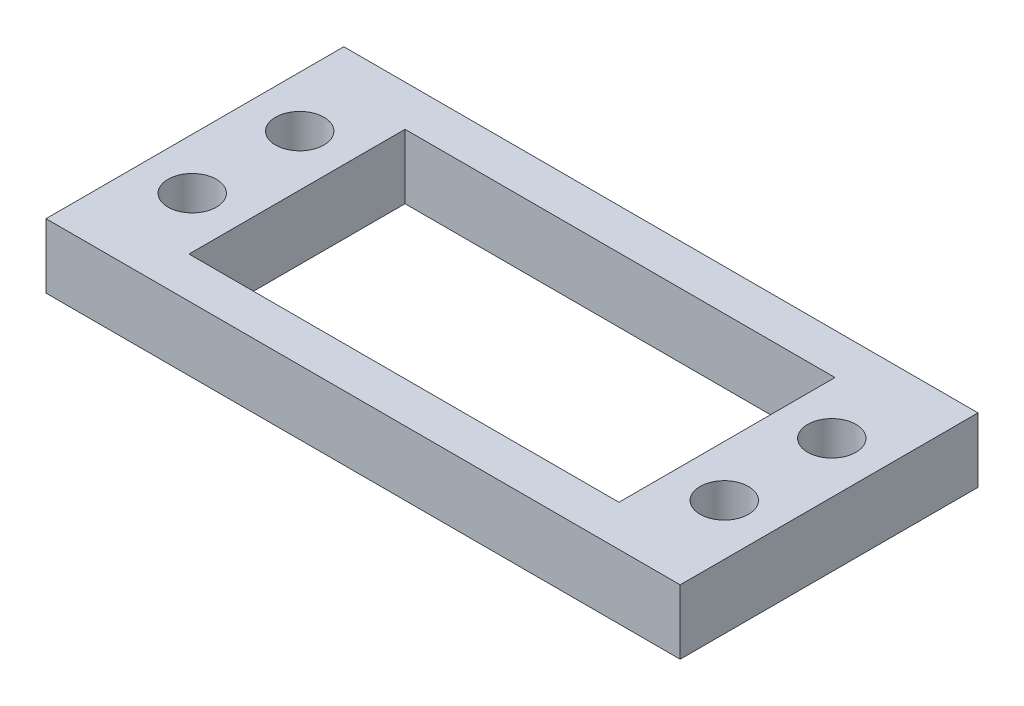
ISO-10303-21;
HEADER;
FILE_DESCRIPTION(('STEP AP214'),'2;1');
FILE_NAME('part.step','',(''),(''),'','','');
FILE_SCHEMA(('AUTOMOTIVE_DESIGN { 1 0 10303 214 1 1 1 1 }'));
ENDSEC;
DATA;
#1=APPLICATION_CONTEXT('core data for automotive mechanical design processes');
#2=APPLICATION_PROTOCOL_DEFINITION('international standard','automotive_design',2000,#1);
#3=PRODUCT_CONTEXT('',#1,'mechanical');
#4=PRODUCT('Part','Part','',(#3));
#5=PRODUCT_RELATED_PRODUCT_CATEGORY('part','',(#4));
#6=PRODUCT_DEFINITION_FORMATION('','',#4);
#7=PRODUCT_DEFINITION_CONTEXT('part definition',#1,'design');
#8=PRODUCT_DEFINITION('design','',#6,#7);
#9=PRODUCT_DEFINITION_SHAPE('','',#8);
#10=(LENGTH_UNIT() NAMED_UNIT(*) SI_UNIT(.MILLI.,.METRE.));
#11=(NAMED_UNIT(*) PLANE_ANGLE_UNIT() SI_UNIT($,.RADIAN.));
#12=(NAMED_UNIT(*) SI_UNIT($,.STERADIAN.) SOLID_ANGLE_UNIT());
#13=UNCERTAINTY_MEASURE_WITH_UNIT(LENGTH_MEASURE(1.E-05),#10,'distance_accuracy_value','');
#14=(GEOMETRIC_REPRESENTATION_CONTEXT(3) GLOBAL_UNCERTAINTY_ASSIGNED_CONTEXT((#13)) GLOBAL_UNIT_ASSIGNED_CONTEXT((#10,
#11,#12)) REPRESENTATION_CONTEXT('',''));
#15=CARTESIAN_POINT('',(0.,0.,0.));
#16=DIRECTION('',(0.,0.,1.));
#17=DIRECTION('',(1.,0.,0.));
#18=AXIS2_PLACEMENT_3D('',#15,#16,#17);
#19=CARTESIAN_POINT('',(0.,6.,0.));
#20=DIRECTION('',(0.,-1.,0.));
#21=DIRECTION('',(0.,0.,-1.));
#22=AXIS2_PLACEMENT_3D('',#19,#20,#21);
#23=PLANE('',#22);
#24=CARTESIAN_POINT('',(54.25,6.,-18.8536348880605));
#25=DIRECTION('',(0.,1.,0.));
#26=DIRECTION('',(0.,0.,1.));
#27=AXIS2_PLACEMENT_3D('',#24,#25,#26);
#28=CIRCLE('',#27,2.25);
#29=CARTESIAN_POINT('',(54.25,6.,-16.6036348880605));
#30=VERTEX_POINT('',#29);
#31=EDGE_CURVE('E134',#30,#30,#28,.T.);
#32=ORIENTED_EDGE('',*,*,#31,.F.);
#33=EDGE_LOOP('',(#32));
#34=FACE_BOUND('',#33,.T.);
#35=CARTESIAN_POINT('',(54.25,6.,-8.85363488806046));
#36=DIRECTION('',(0.,1.,0.));
#37=DIRECTION('',(0.,0.,1.));
#38=AXIS2_PLACEMENT_3D('',#35,#36,#37);
#39=CIRCLE('',#38,2.25);
#40=CARTESIAN_POINT('',(54.25,6.,-6.60363488806046));
#41=VERTEX_POINT('',#40);
#42=EDGE_CURVE('E140',#41,#41,#39,.T.);
#43=ORIENTED_EDGE('',*,*,#42,.F.);
#44=EDGE_LOOP('',(#43));
#45=FACE_BOUND('',#44,.T.);
#46=CARTESIAN_POINT('',(4.74999999999999,6.,-8.85363488806046));
#47=DIRECTION('',(0.,1.,0.));
#48=DIRECTION('',(0.,0.,1.));
#49=AXIS2_PLACEMENT_3D('',#46,#47,#48);
#50=CIRCLE('',#49,2.25);
#51=CARTESIAN_POINT('',(4.74999999999999,6.,-6.60363488806045));
#52=VERTEX_POINT('',#51);
#53=EDGE_CURVE('E146',#52,#52,#50,.T.);
#54=ORIENTED_EDGE('',*,*,#53,.F.);
#55=EDGE_LOOP('',(#54));
#56=FACE_BOUND('',#55,.T.);
#57=CARTESIAN_POINT('',(4.74999999999999,6.,-18.8536348880605));
#58=DIRECTION('',(0.,1.,0.));
#59=DIRECTION('',(0.,0.,1.));
#60=AXIS2_PLACEMENT_3D('',#57,#58,#59);
#61=CIRCLE('',#60,2.25);
#62=CARTESIAN_POINT('',(4.74999999999999,6.,-16.6036348880605));
#63=VERTEX_POINT('',#62);
#64=EDGE_CURVE('E152',#63,#63,#61,.T.);
#65=ORIENTED_EDGE('',*,*,#64,.F.);
#66=EDGE_LOOP('',(#65));
#67=FACE_BOUND('',#66,.T.);
#68=DIRECTION('',(0.,0.,1.));
#69=VECTOR('',#68,1.);
#70=CARTESIAN_POINT('',(0.,6.,0.));
#71=LINE('',#70,#69);
#72=CARTESIAN_POINT('',(0.,6.,-27.7072697761209));
#73=VERTEX_POINT('',#72);
#74=CARTESIAN_POINT('',(0.,6.,0.));
#75=VERTEX_POINT('',#74);
#76=EDGE_CURVE('E158',#73,#75,#71,.T.);
#77=ORIENTED_EDGE('',*,*,#76,.T.);
#78=DIRECTION('',(1.,0.,0.));
#79=VECTOR('',#78,1.);
#80=CARTESIAN_POINT('',(0.,6.,0.));
#81=LINE('',#80,#79);
#82=CARTESIAN_POINT('',(59.,6.,0.));
#83=VERTEX_POINT('',#82);
#84=EDGE_CURVE('E161',#75,#83,#81,.T.);
#85=ORIENTED_EDGE('',*,*,#84,.T.);
#86=DIRECTION('',(0.,0.,-1.));
#87=VECTOR('',#86,1.);
#88=CARTESIAN_POINT('',(59.,6.,0.));
#89=LINE('',#88,#87);
#90=CARTESIAN_POINT('',(59.,6.,-27.7072697761209));
#91=VERTEX_POINT('',#90);
#92=EDGE_CURVE('E164',#83,#91,#89,.T.);
#93=ORIENTED_EDGE('',*,*,#92,.T.);
#94=DIRECTION('',(-1.,0.,0.));
#95=VECTOR('',#94,1.);
#96=CARTESIAN_POINT('',(0.,6.,-27.7072697761209));
#97=LINE('',#96,#95);
#98=EDGE_CURVE('E166',#91,#73,#97,.T.);
#99=ORIENTED_EDGE('',*,*,#98,.T.);
#100=EDGE_LOOP('',(#77,#85,#93,#99));
#101=FACE_BOUND('',#100,.T.);
#102=DIRECTION('',(0.,0.,-1.));
#103=VECTOR('',#102,1.);
#104=CARTESIAN_POINT('',(49.5,6.,-3.80363488806046));
#105=LINE('',#104,#103);
#106=CARTESIAN_POINT('',(49.5,6.,-3.80363488806046));
#107=VERTEX_POINT('',#106);
#108=CARTESIAN_POINT('',(49.5,6.,-23.9036348880605));
#109=VERTEX_POINT('',#108);
#110=EDGE_CURVE('E98',#107,#109,#105,.T.);
#111=ORIENTED_EDGE('',*,*,#110,.F.);
#112=DIRECTION('',(1.,0.,0.));
#113=VECTOR('',#112,1.);
#114=CARTESIAN_POINT('',(9.5,6.,-3.80363488806046));
#115=LINE('',#114,#113);
#116=CARTESIAN_POINT('',(9.5,6.,-3.80363488806046));
#117=VERTEX_POINT('',#116);
#118=EDGE_CURVE('E120',#117,#107,#115,.T.);
#119=ORIENTED_EDGE('',*,*,#118,.F.);
#120=DIRECTION('',(0.,0.,1.));
#121=VECTOR('',#120,1.);
#122=CARTESIAN_POINT('',(9.5,6.,-3.80363488806046));
#123=LINE('',#122,#121);
#124=CARTESIAN_POINT('',(9.5,6.,-23.9036348880605));
#125=VERTEX_POINT('',#124);
#126=EDGE_CURVE('E118',#125,#117,#123,.T.);
#127=ORIENTED_EDGE('',*,*,#126,.F.);
#128=DIRECTION('',(-1.,0.,0.));
#129=VECTOR('',#128,1.);
#130=CARTESIAN_POINT('',(9.5,6.,-23.9036348880605));
#131=LINE('',#130,#129);
#132=EDGE_CURVE('E106',#109,#125,#131,.T.);
#133=ORIENTED_EDGE('',*,*,#132,.F.);
#134=EDGE_LOOP('',(#111,#119,#127,#133));
#135=FACE_BOUND('',#134,.T.);
#136=ADVANCED_FACE('F33',(#34,#45,#56,#67,#101,#135),#23,.F.);
#137=CARTESIAN_POINT('',(0.,0.,0.));
#138=DIRECTION('',(0.,-1.,0.));
#139=DIRECTION('',(0.,0.,-1.));
#140=AXIS2_PLACEMENT_3D('',#137,#138,#139);
#141=PLANE('',#140);
#142=CARTESIAN_POINT('',(54.25,0.,-8.85363488806046));
#143=DIRECTION('',(0.,1.,0.));
#144=DIRECTION('',(0.,0.,1.));
#145=AXIS2_PLACEMENT_3D('',#142,#143,#144);
#146=CIRCLE('',#145,2.25);
#147=CARTESIAN_POINT('',(54.25,0.,-6.60363488806046));
#148=VERTEX_POINT('',#147);
#149=EDGE_CURVE('E137',#148,#148,#146,.T.);
#150=ORIENTED_EDGE('',*,*,#149,.T.);
#151=EDGE_LOOP('',(#150));
#152=FACE_BOUND('',#151,.T.);
#153=CARTESIAN_POINT('',(4.74999999999999,0.,-18.8536348880605));
#154=DIRECTION('',(0.,1.,0.));
#155=DIRECTION('',(0.,0.,1.));
#156=AXIS2_PLACEMENT_3D('',#153,#154,#155);
#157=CIRCLE('',#156,2.25);
#158=CARTESIAN_POINT('',(4.74999999999999,0.,-16.6036348880605));
#159=VERTEX_POINT('',#158);
#160=EDGE_CURVE('E149',#159,#159,#157,.T.);
#161=ORIENTED_EDGE('',*,*,#160,.T.);
#162=EDGE_LOOP('',(#161));
#163=FACE_BOUND('',#162,.T.);
#164=DIRECTION('',(0.,0.,1.));
#165=VECTOR('',#164,1.);
#166=CARTESIAN_POINT('',(0.,0.,0.));
#167=LINE('',#166,#165);
#168=CARTESIAN_POINT('',(0.,0.,-27.7072697761209));
#169=VERTEX_POINT('',#168);
#170=CARTESIAN_POINT('',(0.,0.,0.));
#171=VERTEX_POINT('',#170);
#172=EDGE_CURVE('E155',#169,#171,#167,.T.);
#173=ORIENTED_EDGE('',*,*,#172,.F.);
#174=DIRECTION('',(-1.,0.,0.));
#175=VECTOR('',#174,1.);
#176=CARTESIAN_POINT('',(0.,0.,-27.7072697761209));
#177=LINE('',#176,#175);
#178=CARTESIAN_POINT('',(59.,0.,-27.7072697761209));
#179=VERTEX_POINT('',#178);
#180=EDGE_CURVE('E162',#179,#169,#177,.T.);
#181=ORIENTED_EDGE('',*,*,#180,.F.);
#182=DIRECTION('',(0.,0.,-1.));
#183=VECTOR('',#182,1.);
#184=CARTESIAN_POINT('',(59.,0.,0.));
#185=LINE('',#184,#183);
#186=CARTESIAN_POINT('',(59.,0.,0.));
#187=VERTEX_POINT('',#186);
#188=EDGE_CURVE('E173',#187,#179,#185,.T.);
#189=ORIENTED_EDGE('',*,*,#188,.F.);
#190=DIRECTION('',(1.,0.,0.));
#191=VECTOR('',#190,1.);
#192=CARTESIAN_POINT('',(0.,0.,0.));
#193=LINE('',#192,#191);
#194=EDGE_CURVE('E171',#171,#187,#193,.T.);
#195=ORIENTED_EDGE('',*,*,#194,.F.);
#196=EDGE_LOOP('',(#173,#181,#189,#195));
#197=FACE_BOUND('',#196,.T.);
#198=CARTESIAN_POINT('',(4.74999999999999,0.,-8.85363488806046));
#199=DIRECTION('',(0.,1.,0.));
#200=DIRECTION('',(0.,0.,1.));
#201=AXIS2_PLACEMENT_3D('',#198,#199,#200);
#202=CIRCLE('',#201,2.25);
#203=CARTESIAN_POINT('',(4.74999999999999,0.,-6.60363488806045));
#204=VERTEX_POINT('',#203);
#205=EDGE_CURVE('E143',#204,#204,#202,.T.);
#206=ORIENTED_EDGE('',*,*,#205,.T.);
#207=EDGE_LOOP('',(#206));
#208=FACE_BOUND('',#207,.T.);
#209=CARTESIAN_POINT('',(54.25,0.,-18.8536348880605));
#210=DIRECTION('',(0.,1.,0.));
#211=DIRECTION('',(0.,0.,1.));
#212=AXIS2_PLACEMENT_3D('',#209,#210,#211);
#213=CIRCLE('',#212,2.25);
#214=CARTESIAN_POINT('',(54.25,0.,-16.6036348880605));
#215=VERTEX_POINT('',#214);
#216=EDGE_CURVE('E114',#215,#215,#213,.T.);
#217=ORIENTED_EDGE('',*,*,#216,.T.);
#218=EDGE_LOOP('',(#217));
#219=FACE_BOUND('',#218,.T.);
#220=DIRECTION('',(1.,0.,0.));
#221=VECTOR('',#220,1.);
#222=CARTESIAN_POINT('',(9.5,0.,-3.80363488806046));
#223=LINE('',#222,#221);
#224=CARTESIAN_POINT('',(9.5,0.,-3.80363488806046));
#225=VERTEX_POINT('',#224);
#226=CARTESIAN_POINT('',(49.5,0.,-3.80363488806046));
#227=VERTEX_POINT('',#226);
#228=EDGE_CURVE('E107',#225,#227,#223,.T.);
#229=ORIENTED_EDGE('',*,*,#228,.T.);
#230=DIRECTION('',(0.,0.,-1.));
#231=VECTOR('',#230,1.);
#232=CARTESIAN_POINT('',(49.5,0.,-3.80363488806046));
#233=LINE('',#232,#231);
#234=CARTESIAN_POINT('',(49.5,0.,-23.9036348880605));
#235=VERTEX_POINT('',#234);
#236=EDGE_CURVE('E56',#227,#235,#233,.T.);
#237=ORIENTED_EDGE('',*,*,#236,.T.);
#238=DIRECTION('',(-1.,0.,0.));
#239=VECTOR('',#238,1.);
#240=CARTESIAN_POINT('',(9.5,0.,-23.9036348880605));
#241=LINE('',#240,#239);
#242=CARTESIAN_POINT('',(9.5,0.,-23.9036348880605));
#243=VERTEX_POINT('',#242);
#244=EDGE_CURVE('E113',#235,#243,#241,.T.);
#245=ORIENTED_EDGE('',*,*,#244,.T.);
#246=DIRECTION('',(0.,0.,1.));
#247=VECTOR('',#246,1.);
#248=CARTESIAN_POINT('',(9.5,0.,-3.80363488806046));
#249=LINE('',#248,#247);
#250=EDGE_CURVE('E126',#243,#225,#249,.T.);
#251=ORIENTED_EDGE('',*,*,#250,.T.);
#252=EDGE_LOOP('',(#229,#237,#245,#251));
#253=FACE_BOUND('',#252,.T.);
#254=ADVANCED_FACE('F191',(#152,#163,#197,#208,#219,#253),#141,.T.);
#255=CARTESIAN_POINT('',(0.,6.,0.));
#256=DIRECTION('',(1.,0.,0.));
#257=DIRECTION('',(0.,0.,-1.));
#258=AXIS2_PLACEMENT_3D('',#255,#256,#257);
#259=PLANE('',#258);
#260=ORIENTED_EDGE('',*,*,#172,.T.);
#261=DIRECTION('',(0.,-1.,0.));
#262=VECTOR('',#261,1.);
#263=CARTESIAN_POINT('',(0.,6.,0.));
#264=LINE('',#263,#262);
#265=EDGE_CURVE('E11',#75,#171,#264,.T.);
#266=ORIENTED_EDGE('',*,*,#265,.F.);
#267=ORIENTED_EDGE('',*,*,#76,.F.);
#268=DIRECTION('',(0.,-1.,0.));
#269=VECTOR('',#268,1.);
#270=CARTESIAN_POINT('',(0.,6.,-27.7072697761209));
#271=LINE('',#270,#269);
#272=EDGE_CURVE('E168',#73,#169,#271,.T.);
#273=ORIENTED_EDGE('',*,*,#272,.T.);
#274=EDGE_LOOP('',(#260,#266,#267,#273));
#275=FACE_BOUND('',#274,.T.);
#276=ADVANCED_FACE('F35',(#275),#259,.F.);
#277=CARTESIAN_POINT('',(0.,6.,0.));
#278=DIRECTION('',(0.,0.,-1.));
#279=DIRECTION('',(-1.,0.,0.));
#280=AXIS2_PLACEMENT_3D('',#277,#278,#279);
#281=PLANE('',#280);
#282=ORIENTED_EDGE('',*,*,#194,.T.);
#283=DIRECTION('',(0.,-1.,0.));
#284=VECTOR('',#283,1.);
#285=CARTESIAN_POINT('',(59.,6.,0.));
#286=LINE('',#285,#284);
#287=EDGE_CURVE('E41',#83,#187,#286,.T.);
#288=ORIENTED_EDGE('',*,*,#287,.F.);
#289=ORIENTED_EDGE('',*,*,#84,.F.);
#290=ORIENTED_EDGE('',*,*,#265,.T.);
#291=EDGE_LOOP('',(#282,#288,#289,#290));
#292=FACE_BOUND('',#291,.T.);
#293=ADVANCED_FACE('F201',(#292),#281,.F.);
#294=CARTESIAN_POINT('',(59.,6.,0.));
#295=DIRECTION('',(-1.,0.,0.));
#296=DIRECTION('',(0.,0.,1.));
#297=AXIS2_PLACEMENT_3D('',#294,#295,#296);
#298=PLANE('',#297);
#299=ORIENTED_EDGE('',*,*,#188,.T.);
#300=DIRECTION('',(0.,-1.,0.));
#301=VECTOR('',#300,1.);
#302=CARTESIAN_POINT('',(59.,6.,-27.7072697761209));
#303=LINE('',#302,#301);
#304=EDGE_CURVE('E178',#91,#179,#303,.T.);
#305=ORIENTED_EDGE('',*,*,#304,.F.);
#306=ORIENTED_EDGE('',*,*,#92,.F.);
#307=ORIENTED_EDGE('',*,*,#287,.T.);
#308=EDGE_LOOP('',(#299,#305,#306,#307));
#309=FACE_BOUND('',#308,.T.);
#310=ADVANCED_FACE('F185',(#309),#298,.F.);
#311=CARTESIAN_POINT('',(0.,6.,-27.7072697761209));
#312=DIRECTION('',(0.,0.,1.));
#313=DIRECTION('',(1.,0.,0.));
#314=AXIS2_PLACEMENT_3D('',#311,#312,#313);
#315=PLANE('',#314);
#316=ORIENTED_EDGE('',*,*,#180,.T.);
#317=ORIENTED_EDGE('',*,*,#272,.F.);
#318=ORIENTED_EDGE('',*,*,#98,.F.);
#319=ORIENTED_EDGE('',*,*,#304,.T.);
#320=EDGE_LOOP('',(#316,#317,#318,#319));
#321=FACE_BOUND('',#320,.T.);
#322=ADVANCED_FACE('F195',(#321),#315,.F.);
#323=CARTESIAN_POINT('',(4.74999999999999,6.,-18.8536348880605));
#324=DIRECTION('',(0.,-1.,0.));
#325=DIRECTION('',(0.,0.,-1.));
#326=AXIS2_PLACEMENT_3D('',#323,#324,#325);
#327=CYLINDRICAL_SURFACE('',#326,2.25);
#328=ORIENTED_EDGE('',*,*,#64,.T.);
#329=EDGE_LOOP('',(#328));
#330=FACE_BOUND('',#329,.T.);
#331=ORIENTED_EDGE('',*,*,#160,.F.);
#332=EDGE_LOOP('',(#331));
#333=FACE_BOUND('',#332,.T.);
#334=ADVANCED_FACE('F219',(#330,#333),#327,.F.);
#335=CARTESIAN_POINT('',(4.74999999999999,6.,-8.85363488806046));
#336=DIRECTION('',(0.,-1.,0.));
#337=DIRECTION('',(0.,0.,-1.));
#338=AXIS2_PLACEMENT_3D('',#335,#336,#337);
#339=CYLINDRICAL_SURFACE('',#338,2.25);
#340=ORIENTED_EDGE('',*,*,#53,.T.);
#341=EDGE_LOOP('',(#340));
#342=FACE_BOUND('',#341,.T.);
#343=ORIENTED_EDGE('',*,*,#205,.F.);
#344=EDGE_LOOP('',(#343));
#345=FACE_BOUND('',#344,.T.);
#346=ADVANCED_FACE('F226',(#342,#345),#339,.F.);
#347=CARTESIAN_POINT('',(54.25,6.,-8.85363488806046));
#348=DIRECTION('',(0.,-1.,0.));
#349=DIRECTION('',(0.,0.,-1.));
#350=AXIS2_PLACEMENT_3D('',#347,#348,#349);
#351=CYLINDRICAL_SURFACE('',#350,2.25);
#352=ORIENTED_EDGE('',*,*,#42,.T.);
#353=EDGE_LOOP('',(#352));
#354=FACE_BOUND('',#353,.T.);
#355=ORIENTED_EDGE('',*,*,#149,.F.);
#356=EDGE_LOOP('',(#355));
#357=FACE_BOUND('',#356,.T.);
#358=ADVANCED_FACE('F231',(#354,#357),#351,.F.);
#359=CARTESIAN_POINT('',(54.25,6.,-18.8536348880605));
#360=DIRECTION('',(0.,-1.,0.));
#361=DIRECTION('',(0.,0.,-1.));
#362=AXIS2_PLACEMENT_3D('',#359,#360,#361);
#363=CYLINDRICAL_SURFACE('',#362,2.25);
#364=ORIENTED_EDGE('',*,*,#31,.T.);
#365=EDGE_LOOP('',(#364));
#366=FACE_BOUND('',#365,.T.);
#367=ORIENTED_EDGE('',*,*,#216,.F.);
#368=EDGE_LOOP('',(#367));
#369=FACE_BOUND('',#368,.T.);
#370=ADVANCED_FACE('F241',(#366,#369),#363,.F.);
#371=CARTESIAN_POINT('',(49.5,6.,-3.80363488806046));
#372=DIRECTION('',(-1.,0.,0.));
#373=DIRECTION('',(0.,0.,1.));
#374=AXIS2_PLACEMENT_3D('',#371,#372,#373);
#375=PLANE('',#374);
#376=ORIENTED_EDGE('',*,*,#236,.F.);
#377=DIRECTION('',(0.,-1.,0.));
#378=VECTOR('',#377,1.);
#379=CARTESIAN_POINT('',(49.5,6.,-3.80363488806046));
#380=LINE('',#379,#378);
#381=EDGE_CURVE('E102',#107,#227,#380,.T.);
#382=ORIENTED_EDGE('',*,*,#381,.F.);
#383=ORIENTED_EDGE('',*,*,#110,.T.);
#384=DIRECTION('',(0.,-1.,0.));
#385=VECTOR('',#384,1.);
#386=CARTESIAN_POINT('',(49.5,6.,-23.9036348880605));
#387=LINE('',#386,#385);
#388=EDGE_CURVE('E101',#109,#235,#387,.T.);
#389=ORIENTED_EDGE('',*,*,#388,.T.);
#390=EDGE_LOOP('',(#376,#382,#383,#389));
#391=FACE_BOUND('',#390,.T.);
#392=ADVANCED_FACE('F100',(#391),#375,.T.);
#393=CARTESIAN_POINT('',(9.5,6.,-23.9036348880605));
#394=DIRECTION('',(0.,0.,1.));
#395=DIRECTION('',(1.,0.,0.));
#396=AXIS2_PLACEMENT_3D('',#393,#394,#395);
#397=PLANE('',#396);
#398=ORIENTED_EDGE('',*,*,#244,.F.);
#399=ORIENTED_EDGE('',*,*,#388,.F.);
#400=ORIENTED_EDGE('',*,*,#132,.T.);
#401=DIRECTION('',(0.,-1.,0.));
#402=VECTOR('',#401,1.);
#403=CARTESIAN_POINT('',(9.5,6.,-23.9036348880605));
#404=LINE('',#403,#402);
#405=EDGE_CURVE('E115',#125,#243,#404,.T.);
#406=ORIENTED_EDGE('',*,*,#405,.T.);
#407=EDGE_LOOP('',(#398,#399,#400,#406));
#408=FACE_BOUND('',#407,.T.);
#409=ADVANCED_FACE('F110',(#408),#397,.T.);
#410=CARTESIAN_POINT('',(9.5,6.,-3.80363488806046));
#411=DIRECTION('',(1.,0.,0.));
#412=DIRECTION('',(0.,0.,-1.));
#413=AXIS2_PLACEMENT_3D('',#410,#411,#412);
#414=PLANE('',#413);
#415=ORIENTED_EDGE('',*,*,#250,.F.);
#416=ORIENTED_EDGE('',*,*,#405,.F.);
#417=ORIENTED_EDGE('',*,*,#126,.T.);
#418=DIRECTION('',(0.,-1.,0.));
#419=VECTOR('',#418,1.);
#420=CARTESIAN_POINT('',(9.5,6.,-3.80363488806046));
#421=LINE('',#420,#419);
#422=EDGE_CURVE('E48',#117,#225,#421,.T.);
#423=ORIENTED_EDGE('',*,*,#422,.T.);
#424=EDGE_LOOP('',(#415,#416,#417,#423));
#425=FACE_BOUND('',#424,.T.);
#426=ADVANCED_FACE('F253',(#425),#414,.T.);
#427=CARTESIAN_POINT('',(9.5,6.,-3.80363488806046));
#428=DIRECTION('',(0.,0.,-1.));
#429=DIRECTION('',(-1.,0.,0.));
#430=AXIS2_PLACEMENT_3D('',#427,#428,#429);
#431=PLANE('',#430);
#432=ORIENTED_EDGE('',*,*,#228,.F.);
#433=ORIENTED_EDGE('',*,*,#422,.F.);
#434=ORIENTED_EDGE('',*,*,#118,.T.);
#435=ORIENTED_EDGE('',*,*,#381,.T.);
#436=EDGE_LOOP('',(#432,#433,#434,#435));
#437=FACE_BOUND('',#436,.T.);
#438=ADVANCED_FACE('F256',(#437),#431,.T.);
#439=CLOSED_SHELL('',(#136,#254,#276,#293,#310,#322,#334,#346,#358,#370,#392,#409,#426,#438));
#440=MANIFOLD_SOLID_BREP('B2',#439);
#441=ADVANCED_BREP_SHAPE_REPRESENTATION('',(#18,#440),#14);
#442=SHAPE_DEFINITION_REPRESENTATION(#9,#441);
ENDSEC;
END-ISO-10303-21;
